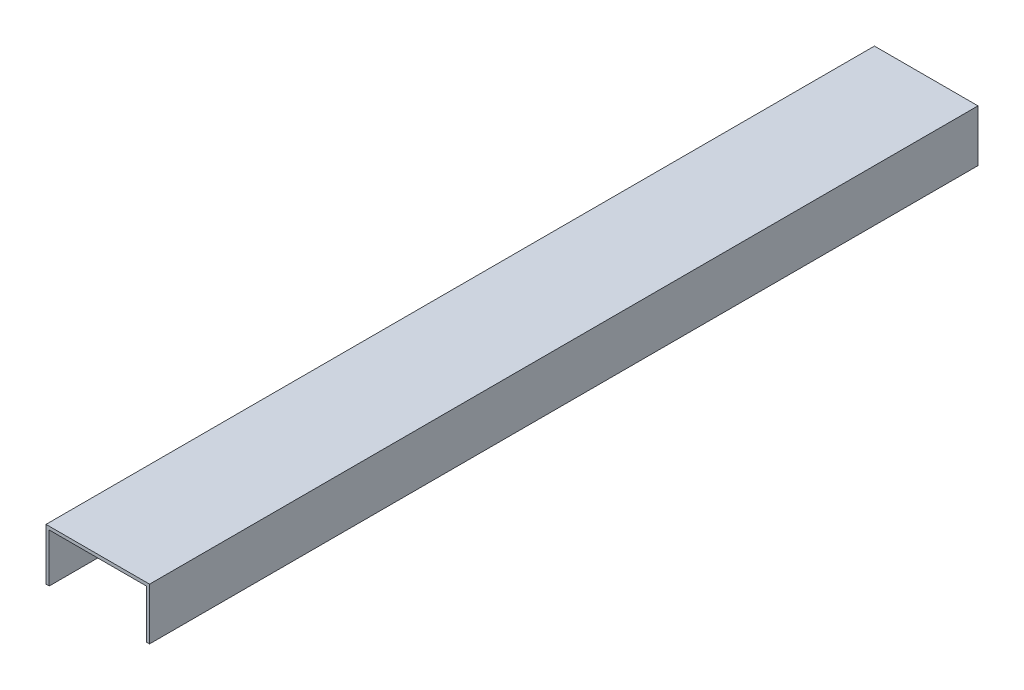
ISO-10303-21;
HEADER;
FILE_DESCRIPTION(('STEP AP214'),'2;1');
FILE_NAME('part.step','',(''),(''),'','','');
FILE_SCHEMA(('AUTOMOTIVE_DESIGN { 1 0 10303 214 1 1 1 1 }'));
ENDSEC;
DATA;
#1=APPLICATION_CONTEXT('core data for automotive mechanical design processes');
#2=APPLICATION_PROTOCOL_DEFINITION('international standard','automotive_design',2000,#1);
#3=PRODUCT_CONTEXT('',#1,'mechanical');
#4=PRODUCT('Part','Part','',(#3));
#5=PRODUCT_RELATED_PRODUCT_CATEGORY('part','',(#4));
#6=PRODUCT_DEFINITION_FORMATION('','',#4);
#7=PRODUCT_DEFINITION_CONTEXT('part definition',#1,'design');
#8=PRODUCT_DEFINITION('design','',#6,#7);
#9=PRODUCT_DEFINITION_SHAPE('','',#8);
#10=(LENGTH_UNIT() NAMED_UNIT(*) SI_UNIT(.MILLI.,.METRE.));
#11=(NAMED_UNIT(*) PLANE_ANGLE_UNIT() SI_UNIT($,.RADIAN.));
#12=(NAMED_UNIT(*) SI_UNIT($,.STERADIAN.) SOLID_ANGLE_UNIT());
#13=UNCERTAINTY_MEASURE_WITH_UNIT(LENGTH_MEASURE(1.E-05),#10,'distance_accuracy_value','');
#14=(GEOMETRIC_REPRESENTATION_CONTEXT(3) GLOBAL_UNCERTAINTY_ASSIGNED_CONTEXT((#13)) GLOBAL_UNIT_ASSIGNED_CONTEXT((#10,
#11,#12)) REPRESENTATION_CONTEXT('',''));
#15=CARTESIAN_POINT('',(0.,0.,0.));
#16=DIRECTION('',(0.,0.,1.));
#17=DIRECTION('',(1.,0.,0.));
#18=AXIS2_PLACEMENT_3D('',#15,#16,#17);
#19=CARTESIAN_POINT('',(0.,0.,812.8));
#20=DIRECTION('',(0.,1.,0.));
#21=DIRECTION('',(0.,0.,1.));
#22=AXIS2_PLACEMENT_3D('',#19,#20,#21);
#23=PLANE('',#22);
#24=DIRECTION('',(1.,0.,0.));
#25=VECTOR('',#24,1.);
#26=CARTESIAN_POINT('',(0.,0.,0.));
#27=LINE('',#26,#25);
#28=CARTESIAN_POINT('',(0.,0.,0.));
#29=VERTEX_POINT('',#28);
#30=CARTESIAN_POINT('',(3.175,0.,0.));
#31=VERTEX_POINT('',#30);
#32=EDGE_CURVE('E132',#29,#31,#27,.T.);
#33=ORIENTED_EDGE('',*,*,#32,.T.);
#34=DIRECTION('',(0.,0.,-1.));
#35=VECTOR('',#34,1.);
#36=CARTESIAN_POINT('',(3.175,0.,812.8));
#37=LINE('',#36,#35);
#38=CARTESIAN_POINT('',(3.175,0.,812.8));
#39=VERTEX_POINT('',#38);
#40=EDGE_CURVE('E11',#39,#31,#37,.T.);
#41=ORIENTED_EDGE('',*,*,#40,.F.);
#42=DIRECTION('',(1.,0.,0.));
#43=VECTOR('',#42,1.);
#44=CARTESIAN_POINT('',(0.,0.,812.8));
#45=LINE('',#44,#43);
#46=CARTESIAN_POINT('',(0.,0.,812.8));
#47=VERTEX_POINT('',#46);
#48=EDGE_CURVE('E146',#47,#39,#45,.T.);
#49=ORIENTED_EDGE('',*,*,#48,.F.);
#50=DIRECTION('',(0.,0.,-1.));
#51=VECTOR('',#50,1.);
#52=CARTESIAN_POINT('',(0.,0.,812.8));
#53=LINE('',#52,#51);
#54=EDGE_CURVE('E128',#47,#29,#53,.T.);
#55=ORIENTED_EDGE('',*,*,#54,.T.);
#56=EDGE_LOOP('',(#33,#41,#49,#55));
#57=FACE_BOUND('',#56,.T.);
#58=ADVANCED_FACE('F35',(#57),#23,.F.);
#59=CARTESIAN_POINT('',(3.175,0.,812.8));
#60=DIRECTION('',(-1.,0.,0.));
#61=DIRECTION('',(0.,0.,1.));
#62=AXIS2_PLACEMENT_3D('',#59,#60,#61);
#63=PLANE('',#62);
#64=DIRECTION('',(0.,1.,0.));
#65=VECTOR('',#64,1.);
#66=CARTESIAN_POINT('',(3.175,0.,0.));
#67=LINE('',#66,#65);
#68=CARTESIAN_POINT('',(3.175,47.625,0.));
#69=VERTEX_POINT('',#68);
#70=EDGE_CURVE('E135',#31,#69,#67,.T.);
#71=ORIENTED_EDGE('',*,*,#70,.T.);
#72=DIRECTION('',(0.,0.,-1.));
#73=VECTOR('',#72,1.);
#74=CARTESIAN_POINT('',(3.175,47.625,812.8));
#75=LINE('',#74,#73);
#76=CARTESIAN_POINT('',(3.175,47.625,812.8));
#77=VERTEX_POINT('',#76);
#78=EDGE_CURVE('E43',#77,#69,#75,.T.);
#79=ORIENTED_EDGE('',*,*,#78,.F.);
#80=DIRECTION('',(0.,1.,0.));
#81=VECTOR('',#80,1.);
#82=CARTESIAN_POINT('',(3.175,0.,812.8));
#83=LINE('',#82,#81);
#84=EDGE_CURVE('E94',#39,#77,#83,.T.);
#85=ORIENTED_EDGE('',*,*,#84,.F.);
#86=ORIENTED_EDGE('',*,*,#40,.T.);
#87=EDGE_LOOP('',(#71,#79,#85,#86));
#88=FACE_BOUND('',#87,.T.);
#89=ADVANCED_FACE('F184',(#88),#63,.F.);
#90=CARTESIAN_POINT('',(3.175,47.625,812.8));
#91=DIRECTION('',(0.,1.,0.));
#92=DIRECTION('',(0.,0.,1.));
#93=AXIS2_PLACEMENT_3D('',#90,#91,#92);
#94=PLANE('',#93);
#95=DIRECTION('',(1.,0.,0.));
#96=VECTOR('',#95,1.);
#97=CARTESIAN_POINT('',(3.175,47.625,0.));
#98=LINE('',#97,#96);
#99=CARTESIAN_POINT('',(98.425,47.625,0.));
#100=VERTEX_POINT('',#99);
#101=EDGE_CURVE('E137',#69,#100,#98,.T.);
#102=ORIENTED_EDGE('',*,*,#101,.T.);
#103=DIRECTION('',(0.,0.,-1.));
#104=VECTOR('',#103,1.);
#105=CARTESIAN_POINT('',(98.425,47.625,812.8));
#106=LINE('',#105,#104);
#107=CARTESIAN_POINT('',(98.425,47.625,812.8));
#108=VERTEX_POINT('',#107);
#109=EDGE_CURVE('E155',#108,#100,#106,.T.);
#110=ORIENTED_EDGE('',*,*,#109,.F.);
#111=DIRECTION('',(1.,0.,0.));
#112=VECTOR('',#111,1.);
#113=CARTESIAN_POINT('',(3.175,47.625,812.8));
#114=LINE('',#113,#112);
#115=EDGE_CURVE('E164',#77,#108,#114,.T.);
#116=ORIENTED_EDGE('',*,*,#115,.F.);
#117=ORIENTED_EDGE('',*,*,#78,.T.);
#118=EDGE_LOOP('',(#102,#110,#116,#117));
#119=FACE_BOUND('',#118,.T.);
#120=ADVANCED_FACE('F162',(#119),#94,.F.);
#121=CARTESIAN_POINT('',(98.425,0.,812.8));
#122=DIRECTION('',(1.,0.,0.));
#123=DIRECTION('',(0.,0.,-1.));
#124=AXIS2_PLACEMENT_3D('',#121,#122,#123);
#125=PLANE('',#124);
#126=DIRECTION('',(0.,-1.,0.));
#127=VECTOR('',#126,1.);
#128=CARTESIAN_POINT('',(98.425,0.,0.));
#129=LINE('',#128,#127);
#130=CARTESIAN_POINT('',(98.425,0.,0.));
#131=VERTEX_POINT('',#130);
#132=EDGE_CURVE('E139',#100,#131,#129,.T.);
#133=ORIENTED_EDGE('',*,*,#132,.T.);
#134=DIRECTION('',(0.,0.,-1.));
#135=VECTOR('',#134,1.);
#136=CARTESIAN_POINT('',(98.425,0.,812.8));
#137=LINE('',#136,#135);
#138=CARTESIAN_POINT('',(98.425,0.,812.8));
#139=VERTEX_POINT('',#138);
#140=EDGE_CURVE('E151',#139,#131,#137,.T.);
#141=ORIENTED_EDGE('',*,*,#140,.F.);
#142=DIRECTION('',(0.,-1.,0.));
#143=VECTOR('',#142,1.);
#144=CARTESIAN_POINT('',(98.425,0.,812.8));
#145=LINE('',#144,#143);
#146=EDGE_CURVE('E176',#108,#139,#145,.T.);
#147=ORIENTED_EDGE('',*,*,#146,.F.);
#148=ORIENTED_EDGE('',*,*,#109,.T.);
#149=EDGE_LOOP('',(#133,#141,#147,#148));
#150=FACE_BOUND('',#149,.T.);
#151=ADVANCED_FACE('F172',(#150),#125,.F.);
#152=CARTESIAN_POINT('',(101.6,0.,812.8));
#153=DIRECTION('',(0.,1.,0.));
#154=DIRECTION('',(0.,0.,1.));
#155=AXIS2_PLACEMENT_3D('',#152,#153,#154);
#156=PLANE('',#155);
#157=DIRECTION('',(1.,0.,0.));
#158=VECTOR('',#157,1.);
#159=CARTESIAN_POINT('',(101.6,0.,0.));
#160=LINE('',#159,#158);
#161=CARTESIAN_POINT('',(101.6,0.,0.));
#162=VERTEX_POINT('',#161);
#163=EDGE_CURVE('E141',#131,#162,#160,.T.);
#164=ORIENTED_EDGE('',*,*,#163,.T.);
#165=DIRECTION('',(0.,0.,-1.));
#166=VECTOR('',#165,1.);
#167=CARTESIAN_POINT('',(101.6,0.,812.8));
#168=LINE('',#167,#166);
#169=CARTESIAN_POINT('',(101.6,0.,812.8));
#170=VERTEX_POINT('',#169);
#171=EDGE_CURVE('E123',#170,#162,#168,.T.);
#172=ORIENTED_EDGE('',*,*,#171,.F.);
#173=DIRECTION('',(1.,0.,0.));
#174=VECTOR('',#173,1.);
#175=CARTESIAN_POINT('',(101.6,0.,812.8));
#176=LINE('',#175,#174);
#177=EDGE_CURVE('E113',#139,#170,#176,.T.);
#178=ORIENTED_EDGE('',*,*,#177,.F.);
#179=ORIENTED_EDGE('',*,*,#140,.T.);
#180=EDGE_LOOP('',(#164,#172,#178,#179));
#181=FACE_BOUND('',#180,.T.);
#182=ADVANCED_FACE('F175',(#181),#156,.F.);
#183=CARTESIAN_POINT('',(101.6,0.,812.8));
#184=DIRECTION('',(-1.,0.,0.));
#185=DIRECTION('',(0.,0.,1.));
#186=AXIS2_PLACEMENT_3D('',#183,#184,#185);
#187=PLANE('',#186);
#188=DIRECTION('',(0.,1.,0.));
#189=VECTOR('',#188,1.);
#190=CARTESIAN_POINT('',(101.6,0.,0.));
#191=LINE('',#190,#189);
#192=CARTESIAN_POINT('',(101.6,50.8,0.));
#193=VERTEX_POINT('',#192);
#194=EDGE_CURVE('E121',#162,#193,#191,.T.);
#195=ORIENTED_EDGE('',*,*,#194,.T.);
#196=DIRECTION('',(0.,0.,-1.));
#197=VECTOR('',#196,1.);
#198=CARTESIAN_POINT('',(101.6,50.8,812.8));
#199=LINE('',#198,#197);
#200=CARTESIAN_POINT('',(101.6,50.8,812.8));
#201=VERTEX_POINT('',#200);
#202=EDGE_CURVE('E118',#201,#193,#199,.T.);
#203=ORIENTED_EDGE('',*,*,#202,.F.);
#204=DIRECTION('',(0.,1.,0.));
#205=VECTOR('',#204,1.);
#206=CARTESIAN_POINT('',(101.6,0.,812.8));
#207=LINE('',#206,#205);
#208=EDGE_CURVE('E107',#170,#201,#207,.T.);
#209=ORIENTED_EDGE('',*,*,#208,.F.);
#210=ORIENTED_EDGE('',*,*,#171,.T.);
#211=EDGE_LOOP('',(#195,#203,#209,#210));
#212=FACE_BOUND('',#211,.T.);
#213=ADVANCED_FACE('F119',(#212),#187,.F.);
#214=CARTESIAN_POINT('',(0.,50.8,812.8));
#215=DIRECTION('',(0.,-1.,0.));
#216=DIRECTION('',(0.,0.,-1.));
#217=AXIS2_PLACEMENT_3D('',#214,#215,#216);
#218=PLANE('',#217);
#219=DIRECTION('',(-1.,0.,0.));
#220=VECTOR('',#219,1.);
#221=CARTESIAN_POINT('',(0.,50.8,0.));
#222=LINE('',#221,#220);
#223=CARTESIAN_POINT('',(0.,50.8,0.));
#224=VERTEX_POINT('',#223);
#225=EDGE_CURVE('E80',#193,#224,#222,.T.);
#226=ORIENTED_EDGE('',*,*,#225,.T.);
#227=DIRECTION('',(0.,0.,-1.));
#228=VECTOR('',#227,1.);
#229=CARTESIAN_POINT('',(0.,50.8,812.8));
#230=LINE('',#229,#228);
#231=CARTESIAN_POINT('',(0.,50.8,812.8));
#232=VERTEX_POINT('',#231);
#233=EDGE_CURVE('E124',#232,#224,#230,.T.);
#234=ORIENTED_EDGE('',*,*,#233,.F.);
#235=DIRECTION('',(-1.,0.,0.));
#236=VECTOR('',#235,1.);
#237=CARTESIAN_POINT('',(0.,50.8,812.8));
#238=LINE('',#237,#236);
#239=EDGE_CURVE('E111',#201,#232,#238,.T.);
#240=ORIENTED_EDGE('',*,*,#239,.F.);
#241=ORIENTED_EDGE('',*,*,#202,.T.);
#242=EDGE_LOOP('',(#226,#234,#240,#241));
#243=FACE_BOUND('',#242,.T.);
#244=ADVANCED_FACE('F126',(#243),#218,.F.);
#245=CARTESIAN_POINT('',(0.,0.,812.8));
#246=DIRECTION('',(1.,0.,0.));
#247=DIRECTION('',(0.,0.,-1.));
#248=AXIS2_PLACEMENT_3D('',#245,#246,#247);
#249=PLANE('',#248);
#250=DIRECTION('',(0.,-1.,0.));
#251=VECTOR('',#250,1.);
#252=CARTESIAN_POINT('',(0.,0.,0.));
#253=LINE('',#252,#251);
#254=EDGE_CURVE('E86',#224,#29,#253,.T.);
#255=ORIENTED_EDGE('',*,*,#254,.T.);
#256=ORIENTED_EDGE('',*,*,#54,.F.);
#257=DIRECTION('',(0.,-1.,0.));
#258=VECTOR('',#257,1.);
#259=CARTESIAN_POINT('',(0.,0.,812.8));
#260=LINE('',#259,#258);
#261=EDGE_CURVE('E51',#232,#47,#260,.T.);
#262=ORIENTED_EDGE('',*,*,#261,.F.);
#263=ORIENTED_EDGE('',*,*,#233,.T.);
#264=EDGE_LOOP('',(#255,#256,#262,#263));
#265=FACE_BOUND('',#264,.T.);
#266=ADVANCED_FACE('F200',(#265),#249,.F.);
#267=CARTESIAN_POINT('',(0.,0.,812.8));
#268=DIRECTION('',(0.,0.,1.));
#269=DIRECTION('',(1.,0.,0.));
#270=AXIS2_PLACEMENT_3D('',#267,#268,#269);
#271=PLANE('',#270);
#272=ORIENTED_EDGE('',*,*,#48,.T.);
#273=ORIENTED_EDGE('',*,*,#84,.T.);
#274=ORIENTED_EDGE('',*,*,#115,.T.);
#275=ORIENTED_EDGE('',*,*,#146,.T.);
#276=ORIENTED_EDGE('',*,*,#177,.T.);
#277=ORIENTED_EDGE('',*,*,#208,.T.);
#278=ORIENTED_EDGE('',*,*,#239,.T.);
#279=ORIENTED_EDGE('',*,*,#261,.T.);
#280=EDGE_LOOP('',(#272,#273,#274,#275,#276,#277,#278,#279));
#281=FACE_BOUND('',#280,.T.);
#282=ADVANCED_FACE('F109',(#281),#271,.T.);
#283=CARTESIAN_POINT('',(0.,0.,0.));
#284=DIRECTION('',(0.,0.,1.));
#285=DIRECTION('',(1.,0.,0.));
#286=AXIS2_PLACEMENT_3D('',#283,#284,#285);
#287=PLANE('',#286);
#288=ORIENTED_EDGE('',*,*,#32,.F.);
#289=ORIENTED_EDGE('',*,*,#254,.F.);
#290=ORIENTED_EDGE('',*,*,#225,.F.);
#291=ORIENTED_EDGE('',*,*,#194,.F.);
#292=ORIENTED_EDGE('',*,*,#163,.F.);
#293=ORIENTED_EDGE('',*,*,#132,.F.);
#294=ORIENTED_EDGE('',*,*,#101,.F.);
#295=ORIENTED_EDGE('',*,*,#70,.F.);
#296=EDGE_LOOP('',(#288,#289,#290,#291,#292,#293,#294,#295));
#297=FACE_BOUND('',#296,.T.);
#298=ADVANCED_FACE('F168',(#297),#287,.F.);
#299=CLOSED_SHELL('',(#58,#89,#120,#151,#182,#213,#244,#266,#282,#298));
#300=MANIFOLD_SOLID_BREP('B2',#299);
#301=ADVANCED_BREP_SHAPE_REPRESENTATION('',(#18,#300),#14);
#302=SHAPE_DEFINITION_REPRESENTATION(#9,#301);
ENDSEC;
END-ISO-10303-21;
